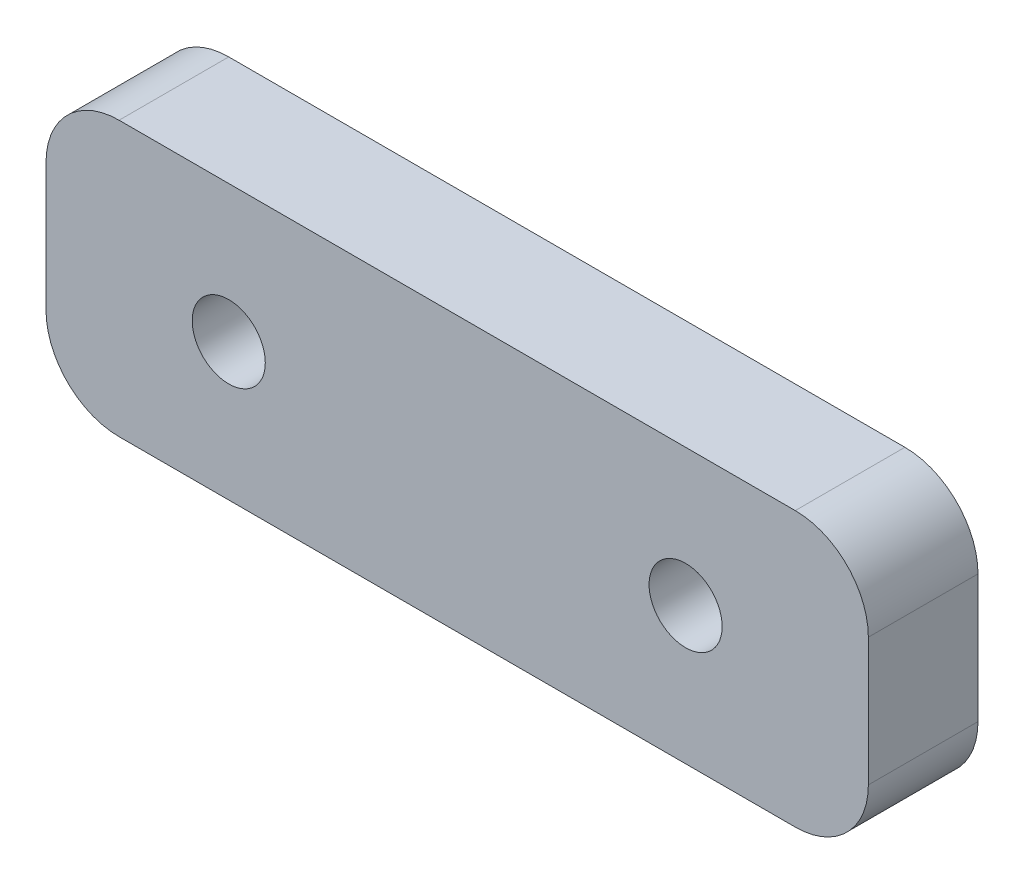
ISO-10303-21;
HEADER;
FILE_DESCRIPTION(('STEP AP214'),'2;1');
FILE_NAME('part.step','',(''),(''),'','','');
FILE_SCHEMA(('AUTOMOTIVE_DESIGN { 1 0 10303 214 1 1 1 1 }'));
ENDSEC;
DATA;
#1=APPLICATION_CONTEXT('core data for automotive mechanical design processes');
#2=APPLICATION_PROTOCOL_DEFINITION('international standard','automotive_design',2000,#1);
#3=PRODUCT_CONTEXT('',#1,'mechanical');
#4=PRODUCT('Part','Part','',(#3));
#5=PRODUCT_RELATED_PRODUCT_CATEGORY('part','',(#4));
#6=PRODUCT_DEFINITION_FORMATION('','',#4);
#7=PRODUCT_DEFINITION_CONTEXT('part definition',#1,'design');
#8=PRODUCT_DEFINITION('design','',#6,#7);
#9=PRODUCT_DEFINITION_SHAPE('','',#8);
#10=(LENGTH_UNIT() NAMED_UNIT(*) SI_UNIT(.MILLI.,.METRE.));
#11=(NAMED_UNIT(*) PLANE_ANGLE_UNIT() SI_UNIT($,.RADIAN.));
#12=(NAMED_UNIT(*) SI_UNIT($,.STERADIAN.) SOLID_ANGLE_UNIT());
#13=UNCERTAINTY_MEASURE_WITH_UNIT(LENGTH_MEASURE(1.E-05),#10,'distance_accuracy_value','');
#14=(GEOMETRIC_REPRESENTATION_CONTEXT(3) GLOBAL_UNCERTAINTY_ASSIGNED_CONTEXT((#13)) GLOBAL_UNIT_ASSIGNED_CONTEXT((#10,
#11,#12)) REPRESENTATION_CONTEXT('',''));
#15=CARTESIAN_POINT('',(0.,0.,0.));
#16=DIRECTION('',(0.,0.,1.));
#17=DIRECTION('',(1.,0.,0.));
#18=AXIS2_PLACEMENT_3D('',#15,#16,#17);
#19=CARTESIAN_POINT('',(0.,0.,6.));
#20=DIRECTION('',(0.,0.,-1.));
#21=DIRECTION('',(-1.,0.,0.));
#22=AXIS2_PLACEMENT_3D('',#19,#20,#21);
#23=PLANE('',#22);
#24=DIRECTION('',(-1.,0.,0.));
#25=VECTOR('',#24,1.);
#26=CARTESIAN_POINT('',(-10.,7.5,6.));
#27=LINE('',#26,#25);
#28=CARTESIAN_POINT('',(31.,7.5,6.));
#29=VERTEX_POINT('',#28);
#30=CARTESIAN_POINT('',(-6.,7.5,6.));
#31=VERTEX_POINT('',#30);
#32=EDGE_CURVE('E154',#29,#31,#27,.T.);
#33=ORIENTED_EDGE('',*,*,#32,.T.);
#34=CARTESIAN_POINT('',(-6.,3.5,6.));
#35=DIRECTION('',(0.,0.,-1.));
#36=DIRECTION('',(-1.,0.,0.));
#37=AXIS2_PLACEMENT_3D('',#34,#35,#36);
#38=CIRCLE('',#37,4.);
#39=CARTESIAN_POINT('',(-10.,3.5,6.));
#40=VERTEX_POINT('',#39);
#41=EDGE_CURVE('E183',#31,#40,#38,.F.);
#42=ORIENTED_EDGE('',*,*,#41,.T.);
#43=DIRECTION('',(0.,-1.,0.));
#44=VECTOR('',#43,1.);
#45=CARTESIAN_POINT('',(-10.,-7.5,6.));
#46=LINE('',#45,#44);
#47=CARTESIAN_POINT('',(-10.,-3.5,6.));
#48=VERTEX_POINT('',#47);
#49=EDGE_CURVE('E132',#40,#48,#46,.T.);
#50=ORIENTED_EDGE('',*,*,#49,.T.);
#51=CARTESIAN_POINT('',(-6.,-3.5,6.));
#52=DIRECTION('',(0.,0.,-1.));
#53=DIRECTION('',(-1.,0.,0.));
#54=AXIS2_PLACEMENT_3D('',#51,#52,#53);
#55=CIRCLE('',#54,4.);
#56=CARTESIAN_POINT('',(-6.,-7.5,6.));
#57=VERTEX_POINT('',#56);
#58=EDGE_CURVE('E178',#48,#57,#55,.F.);
#59=ORIENTED_EDGE('',*,*,#58,.T.);
#60=DIRECTION('',(1.,0.,0.));
#61=VECTOR('',#60,1.);
#62=CARTESIAN_POINT('',(-10.,-7.5,6.));
#63=LINE('',#62,#61);
#64=CARTESIAN_POINT('',(31.,-7.5,6.));
#65=VERTEX_POINT('',#64);
#66=EDGE_CURVE('E198',#57,#65,#63,.T.);
#67=ORIENTED_EDGE('',*,*,#66,.T.);
#68=CARTESIAN_POINT('',(31.,-3.5,6.));
#69=DIRECTION('',(0.,0.,-1.));
#70=DIRECTION('',(-1.,0.,0.));
#71=AXIS2_PLACEMENT_3D('',#68,#69,#70);
#72=CIRCLE('',#71,4.);
#73=CARTESIAN_POINT('',(35.,-3.5,6.));
#74=VERTEX_POINT('',#73);
#75=EDGE_CURVE('E67',#65,#74,#72,.F.);
#76=ORIENTED_EDGE('',*,*,#75,.T.);
#77=DIRECTION('',(0.,1.,0.));
#78=VECTOR('',#77,1.);
#79=CARTESIAN_POINT('',(35.,-7.5,6.));
#80=LINE('',#79,#78);
#81=CARTESIAN_POINT('',(35.,3.5,6.));
#82=VERTEX_POINT('',#81);
#83=EDGE_CURVE('E206',#74,#82,#80,.T.);
#84=ORIENTED_EDGE('',*,*,#83,.T.);
#85=CARTESIAN_POINT('',(31.,3.5,6.));
#86=DIRECTION('',(0.,0.,-1.));
#87=DIRECTION('',(-1.,0.,0.));
#88=AXIS2_PLACEMENT_3D('',#85,#86,#87);
#89=CIRCLE('',#88,4.);
#90=EDGE_CURVE('E175',#82,#29,#89,.F.);
#91=ORIENTED_EDGE('',*,*,#90,.T.);
#92=EDGE_LOOP('',(#33,#42,#50,#59,#67,#76,#84,#91));
#93=FACE_BOUND('',#92,.T.);
#94=CARTESIAN_POINT('',(0.,0.,6.));
#95=DIRECTION('',(0.,0.,1.));
#96=DIRECTION('',(1.,0.,0.));
#97=AXIS2_PLACEMENT_3D('',#94,#95,#96);
#98=CIRCLE('',#97,2.);
#99=CARTESIAN_POINT('',(2.,0.,6.));
#100=VERTEX_POINT('',#99);
#101=EDGE_CURVE('E143',#100,#100,#98,.T.);
#102=ORIENTED_EDGE('',*,*,#101,.F.);
#103=EDGE_LOOP('',(#102));
#104=FACE_BOUND('',#103,.T.);
#105=CARTESIAN_POINT('',(25.,0.,6.));
#106=DIRECTION('',(0.,0.,1.));
#107=DIRECTION('',(1.,0.,0.));
#108=AXIS2_PLACEMENT_3D('',#105,#106,#107);
#109=CIRCLE('',#108,2.);
#110=CARTESIAN_POINT('',(27.,0.,6.));
#111=VERTEX_POINT('',#110);
#112=EDGE_CURVE('E218',#111,#111,#109,.T.);
#113=ORIENTED_EDGE('',*,*,#112,.F.);
#114=EDGE_LOOP('',(#113));
#115=FACE_BOUND('',#114,.T.);
#116=ADVANCED_FACE('F44',(#93,#104,#115),#23,.F.);
#117=CARTESIAN_POINT('',(0.,0.,0.));
#118=DIRECTION('',(0.,0.,-1.));
#119=DIRECTION('',(-1.,0.,0.));
#120=AXIS2_PLACEMENT_3D('',#117,#118,#119);
#121=PLANE('',#120);
#122=CARTESIAN_POINT('',(0.,0.,0.));
#123=DIRECTION('',(0.,0.,1.));
#124=DIRECTION('',(1.,0.,0.));
#125=AXIS2_PLACEMENT_3D('',#122,#123,#124);
#126=CIRCLE('',#125,2.);
#127=CARTESIAN_POINT('',(2.,0.,0.));
#128=VERTEX_POINT('',#127);
#129=EDGE_CURVE('E151',#128,#128,#126,.T.);
#130=ORIENTED_EDGE('',*,*,#129,.T.);
#131=EDGE_LOOP('',(#130));
#132=FACE_BOUND('',#131,.T.);
#133=DIRECTION('',(0.,-1.,0.));
#134=VECTOR('',#133,1.);
#135=CARTESIAN_POINT('',(-10.,-7.5,0.));
#136=LINE('',#135,#134);
#137=CARTESIAN_POINT('',(-10.,3.5,0.));
#138=VERTEX_POINT('',#137);
#139=CARTESIAN_POINT('',(-10.,-3.5,0.));
#140=VERTEX_POINT('',#139);
#141=EDGE_CURVE('E129',#138,#140,#136,.T.);
#142=ORIENTED_EDGE('',*,*,#141,.F.);
#143=CARTESIAN_POINT('',(-6.,3.5,0.));
#144=DIRECTION('',(0.,0.,-1.));
#145=DIRECTION('',(-1.,0.,0.));
#146=AXIS2_PLACEMENT_3D('',#143,#144,#145);
#147=CIRCLE('',#146,4.);
#148=CARTESIAN_POINT('',(-6.,7.5,0.));
#149=VERTEX_POINT('',#148);
#150=EDGE_CURVE('E111',#138,#149,#147,.T.);
#151=ORIENTED_EDGE('',*,*,#150,.T.);
#152=DIRECTION('',(-1.,0.,0.));
#153=VECTOR('',#152,1.);
#154=CARTESIAN_POINT('',(-10.,7.5,0.));
#155=LINE('',#154,#153);
#156=CARTESIAN_POINT('',(31.,7.5,0.));
#157=VERTEX_POINT('',#156);
#158=EDGE_CURVE('E159',#157,#149,#155,.T.);
#159=ORIENTED_EDGE('',*,*,#158,.F.);
#160=CARTESIAN_POINT('',(31.,3.5,0.));
#161=DIRECTION('',(0.,0.,-1.));
#162=DIRECTION('',(-1.,0.,0.));
#163=AXIS2_PLACEMENT_3D('',#160,#161,#162);
#164=CIRCLE('',#163,4.);
#165=CARTESIAN_POINT('',(35.,3.5,0.));
#166=VERTEX_POINT('',#165);
#167=EDGE_CURVE('E134',#157,#166,#164,.T.);
#168=ORIENTED_EDGE('',*,*,#167,.T.);
#169=DIRECTION('',(0.,1.,0.));
#170=VECTOR('',#169,1.);
#171=CARTESIAN_POINT('',(35.,-7.5,0.));
#172=LINE('',#171,#170);
#173=CARTESIAN_POINT('',(35.,-3.5,0.));
#174=VERTEX_POINT('',#173);
#175=EDGE_CURVE('E148',#174,#166,#172,.T.);
#176=ORIENTED_EDGE('',*,*,#175,.F.);
#177=CARTESIAN_POINT('',(31.,-3.5,0.));
#178=DIRECTION('',(0.,0.,-1.));
#179=DIRECTION('',(-1.,0.,0.));
#180=AXIS2_PLACEMENT_3D('',#177,#178,#179);
#181=CIRCLE('',#180,4.);
#182=CARTESIAN_POINT('',(31.,-7.5,0.));
#183=VERTEX_POINT('',#182);
#184=EDGE_CURVE('E123',#174,#183,#181,.T.);
#185=ORIENTED_EDGE('',*,*,#184,.T.);
#186=DIRECTION('',(1.,0.,0.));
#187=VECTOR('',#186,1.);
#188=CARTESIAN_POINT('',(-10.,-7.5,0.));
#189=LINE('',#188,#187);
#190=CARTESIAN_POINT('',(-6.,-7.5,0.));
#191=VERTEX_POINT('',#190);
#192=EDGE_CURVE('E142',#191,#183,#189,.T.);
#193=ORIENTED_EDGE('',*,*,#192,.F.);
#194=CARTESIAN_POINT('',(-6.,-3.5,0.));
#195=DIRECTION('',(0.,0.,-1.));
#196=DIRECTION('',(-1.,0.,0.));
#197=AXIS2_PLACEMENT_3D('',#194,#195,#196);
#198=CIRCLE('',#197,4.);
#199=EDGE_CURVE('E140',#191,#140,#198,.T.);
#200=ORIENTED_EDGE('',*,*,#199,.T.);
#201=EDGE_LOOP('',(#142,#151,#159,#168,#176,#185,#193,#200));
#202=FACE_BOUND('',#201,.T.);
#203=CARTESIAN_POINT('',(25.,0.,0.));
#204=DIRECTION('',(0.,0.,1.));
#205=DIRECTION('',(1.,0.,0.));
#206=AXIS2_PLACEMENT_3D('',#203,#204,#205);
#207=CIRCLE('',#206,2.);
#208=CARTESIAN_POINT('',(27.,0.,0.));
#209=VERTEX_POINT('',#208);
#210=EDGE_CURVE('E220',#209,#209,#207,.T.);
#211=ORIENTED_EDGE('',*,*,#210,.T.);
#212=EDGE_LOOP('',(#211));
#213=FACE_BOUND('',#212,.T.);
#214=ADVANCED_FACE('F137',(#132,#202,#213),#121,.T.);
#215=CARTESIAN_POINT('',(-10.,-7.5,6.));
#216=DIRECTION('',(1.,0.,0.));
#217=DIRECTION('',(0.,0.,-1.));
#218=AXIS2_PLACEMENT_3D('',#215,#216,#217);
#219=PLANE('',#218);
#220=ORIENTED_EDGE('',*,*,#49,.F.);
#221=DIRECTION('',(0.,0.,-1.));
#222=VECTOR('',#221,1.);
#223=CARTESIAN_POINT('',(-10.,3.5,6.));
#224=LINE('',#223,#222);
#225=EDGE_CURVE('E115',#40,#138,#224,.T.);
#226=ORIENTED_EDGE('',*,*,#225,.T.);
#227=ORIENTED_EDGE('',*,*,#141,.T.);
#228=DIRECTION('',(0.,0.,-1.));
#229=VECTOR('',#228,1.);
#230=CARTESIAN_POINT('',(-10.,-3.5,6.));
#231=LINE('',#230,#229);
#232=EDGE_CURVE('E135',#140,#48,#231,.F.);
#233=ORIENTED_EDGE('',*,*,#232,.T.);
#234=EDGE_LOOP('',(#220,#226,#227,#233));
#235=FACE_BOUND('',#234,.T.);
#236=ADVANCED_FACE('F128',(#235),#219,.F.);
#237=CARTESIAN_POINT('',(-10.,-7.5,6.));
#238=DIRECTION('',(0.,1.,0.));
#239=DIRECTION('',(0.,0.,1.));
#240=AXIS2_PLACEMENT_3D('',#237,#238,#239);
#241=PLANE('',#240);
#242=ORIENTED_EDGE('',*,*,#192,.T.);
#243=DIRECTION('',(0.,0.,-1.));
#244=VECTOR('',#243,1.);
#245=CARTESIAN_POINT('',(31.,-7.5,6.));
#246=LINE('',#245,#244);
#247=EDGE_CURVE('E11',#183,#65,#246,.F.);
#248=ORIENTED_EDGE('',*,*,#247,.T.);
#249=ORIENTED_EDGE('',*,*,#66,.F.);
#250=DIRECTION('',(0.,0.,-1.));
#251=VECTOR('',#250,1.);
#252=CARTESIAN_POINT('',(-6.,-7.5,6.));
#253=LINE('',#252,#251);
#254=EDGE_CURVE('E53',#57,#191,#253,.T.);
#255=ORIENTED_EDGE('',*,*,#254,.T.);
#256=EDGE_LOOP('',(#242,#248,#249,#255));
#257=FACE_BOUND('',#256,.T.);
#258=ADVANCED_FACE('F196',(#257),#241,.F.);
#259=CARTESIAN_POINT('',(35.,-7.5,6.));
#260=DIRECTION('',(-1.,0.,0.));
#261=DIRECTION('',(0.,0.,1.));
#262=AXIS2_PLACEMENT_3D('',#259,#260,#261);
#263=PLANE('',#262);
#264=ORIENTED_EDGE('',*,*,#83,.F.);
#265=DIRECTION('',(0.,0.,-1.));
#266=VECTOR('',#265,1.);
#267=CARTESIAN_POINT('',(35.,-3.5,6.));
#268=LINE('',#267,#266);
#269=EDGE_CURVE('E188',#74,#174,#268,.T.);
#270=ORIENTED_EDGE('',*,*,#269,.T.);
#271=ORIENTED_EDGE('',*,*,#175,.T.);
#272=DIRECTION('',(0.,0.,-1.));
#273=VECTOR('',#272,1.);
#274=CARTESIAN_POINT('',(35.,3.5,6.));
#275=LINE('',#274,#273);
#276=EDGE_CURVE('E60',#166,#82,#275,.F.);
#277=ORIENTED_EDGE('',*,*,#276,.T.);
#278=EDGE_LOOP('',(#264,#270,#271,#277));
#279=FACE_BOUND('',#278,.T.);
#280=ADVANCED_FACE('F205',(#279),#263,.F.);
#281=CARTESIAN_POINT('',(-10.,7.5,6.));
#282=DIRECTION('',(0.,-1.,0.));
#283=DIRECTION('',(0.,0.,-1.));
#284=AXIS2_PLACEMENT_3D('',#281,#282,#283);
#285=PLANE('',#284);
#286=ORIENTED_EDGE('',*,*,#158,.T.);
#287=DIRECTION('',(0.,0.,-1.));
#288=VECTOR('',#287,1.);
#289=CARTESIAN_POINT('',(-6.,7.5,6.));
#290=LINE('',#289,#288);
#291=EDGE_CURVE('E116',#149,#31,#290,.F.);
#292=ORIENTED_EDGE('',*,*,#291,.T.);
#293=ORIENTED_EDGE('',*,*,#32,.F.);
#294=DIRECTION('',(0.,0.,-1.));
#295=VECTOR('',#294,1.);
#296=CARTESIAN_POINT('',(31.,7.5,6.));
#297=LINE('',#296,#295);
#298=EDGE_CURVE('E122',#29,#157,#297,.T.);
#299=ORIENTED_EDGE('',*,*,#298,.T.);
#300=EDGE_LOOP('',(#286,#292,#293,#299));
#301=FACE_BOUND('',#300,.T.);
#302=ADVANCED_FACE('F244',(#301),#285,.F.);
#303=CARTESIAN_POINT('',(0.,0.,6.));
#304=DIRECTION('',(0.,0.,-1.));
#305=DIRECTION('',(-1.,0.,0.));
#306=AXIS2_PLACEMENT_3D('',#303,#304,#305);
#307=CYLINDRICAL_SURFACE('',#306,2.);
#308=ORIENTED_EDGE('',*,*,#101,.T.);
#309=EDGE_LOOP('',(#308));
#310=FACE_BOUND('',#309,.T.);
#311=ORIENTED_EDGE('',*,*,#129,.F.);
#312=EDGE_LOOP('',(#311));
#313=FACE_BOUND('',#312,.T.);
#314=ADVANCED_FACE('F241',(#310,#313),#307,.F.);
#315=CARTESIAN_POINT('',(25.,0.,6.));
#316=DIRECTION('',(0.,0.,-1.));
#317=DIRECTION('',(-1.,0.,0.));
#318=AXIS2_PLACEMENT_3D('',#315,#316,#317);
#319=CYLINDRICAL_SURFACE('',#318,2.);
#320=ORIENTED_EDGE('',*,*,#112,.T.);
#321=EDGE_LOOP('',(#320));
#322=FACE_BOUND('',#321,.T.);
#323=ORIENTED_EDGE('',*,*,#210,.F.);
#324=EDGE_LOOP('',(#323));
#325=FACE_BOUND('',#324,.T.);
#326=ADVANCED_FACE('F228',(#322,#325),#319,.F.);
#327=CARTESIAN_POINT('',(-6.,3.5,6.));
#328=DIRECTION('',(0.,0.,-1.));
#329=DIRECTION('',(-1.,0.,0.));
#330=AXIS2_PLACEMENT_3D('',#327,#328,#329);
#331=CYLINDRICAL_SURFACE('',#330,4.);
#332=ORIENTED_EDGE('',*,*,#41,.F.);
#333=ORIENTED_EDGE('',*,*,#291,.F.);
#334=ORIENTED_EDGE('',*,*,#150,.F.);
#335=ORIENTED_EDGE('',*,*,#225,.F.);
#336=EDGE_LOOP('',(#332,#333,#334,#335));
#337=FACE_BOUND('',#336,.T.);
#338=ADVANCED_FACE('F114',(#337),#331,.T.);
#339=CARTESIAN_POINT('',(31.,-3.5,6.));
#340=DIRECTION('',(0.,0.,-1.));
#341=DIRECTION('',(-1.,0.,0.));
#342=AXIS2_PLACEMENT_3D('',#339,#340,#341);
#343=CYLINDRICAL_SURFACE('',#342,4.);
#344=ORIENTED_EDGE('',*,*,#75,.F.);
#345=ORIENTED_EDGE('',*,*,#247,.F.);
#346=ORIENTED_EDGE('',*,*,#184,.F.);
#347=ORIENTED_EDGE('',*,*,#269,.F.);
#348=EDGE_LOOP('',(#344,#345,#346,#347));
#349=FACE_BOUND('',#348,.T.);
#350=ADVANCED_FACE('F204',(#349),#343,.T.);
#351=CARTESIAN_POINT('',(-6.,-3.5,6.));
#352=DIRECTION('',(0.,0.,-1.));
#353=DIRECTION('',(-1.,0.,0.));
#354=AXIS2_PLACEMENT_3D('',#351,#352,#353);
#355=CYLINDRICAL_SURFACE('',#354,4.);
#356=ORIENTED_EDGE('',*,*,#58,.F.);
#357=ORIENTED_EDGE('',*,*,#232,.F.);
#358=ORIENTED_EDGE('',*,*,#199,.F.);
#359=ORIENTED_EDGE('',*,*,#254,.F.);
#360=EDGE_LOOP('',(#356,#357,#358,#359));
#361=FACE_BOUND('',#360,.T.);
#362=ADVANCED_FACE('F257',(#361),#355,.T.);
#363=CARTESIAN_POINT('',(31.,3.5,6.));
#364=DIRECTION('',(0.,0.,-1.));
#365=DIRECTION('',(-1.,0.,0.));
#366=AXIS2_PLACEMENT_3D('',#363,#364,#365);
#367=CYLINDRICAL_SURFACE('',#366,4.);
#368=ORIENTED_EDGE('',*,*,#90,.F.);
#369=ORIENTED_EDGE('',*,*,#276,.F.);
#370=ORIENTED_EDGE('',*,*,#167,.F.);
#371=ORIENTED_EDGE('',*,*,#298,.F.);
#372=EDGE_LOOP('',(#368,#369,#370,#371));
#373=FACE_BOUND('',#372,.T.);
#374=ADVANCED_FACE('F46',(#373),#367,.T.);
#375=CLOSED_SHELL('',(#116,#214,#236,#258,#280,#302,#314,#326,#338,#350,#362,#374));
#376=MANIFOLD_SOLID_BREP('B2',#375);
#377=ADVANCED_BREP_SHAPE_REPRESENTATION('',(#18,#376),#14);
#378=SHAPE_DEFINITION_REPRESENTATION(#9,#377);
ENDSEC;
END-ISO-10303-21;
